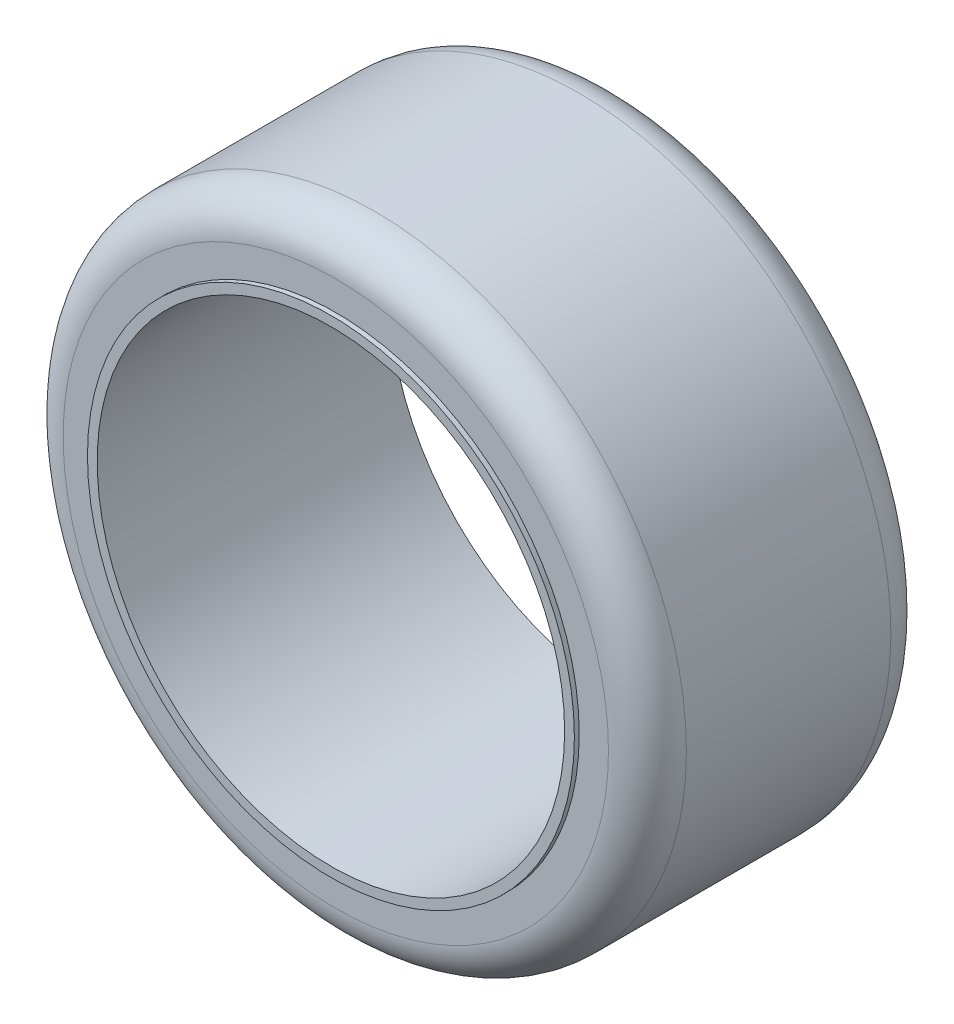
ISO-10303-21;
HEADER;
FILE_DESCRIPTION(('STEP AP214'),'2;1');
FILE_NAME('part.step','',(''),(''),'','','');
FILE_SCHEMA(('AUTOMOTIVE_DESIGN { 1 0 10303 214 1 1 1 1 }'));
ENDSEC;
DATA;
#1=APPLICATION_CONTEXT('core data for automotive mechanical design processes');
#2=APPLICATION_PROTOCOL_DEFINITION('international standard','automotive_design',2000,#1);
#3=PRODUCT_CONTEXT('',#1,'mechanical');
#4=PRODUCT('Part','Part','',(#3));
#5=PRODUCT_RELATED_PRODUCT_CATEGORY('part','',(#4));
#6=PRODUCT_DEFINITION_FORMATION('','',#4);
#7=PRODUCT_DEFINITION_CONTEXT('part definition',#1,'design');
#8=PRODUCT_DEFINITION('design','',#6,#7);
#9=PRODUCT_DEFINITION_SHAPE('','',#8);
#10=(LENGTH_UNIT() NAMED_UNIT(*) SI_UNIT(.MILLI.,.METRE.));
#11=(NAMED_UNIT(*) PLANE_ANGLE_UNIT() SI_UNIT($,.RADIAN.));
#12=(NAMED_UNIT(*) SI_UNIT($,.STERADIAN.) SOLID_ANGLE_UNIT());
#13=UNCERTAINTY_MEASURE_WITH_UNIT(LENGTH_MEASURE(1.E-05),#10,'distance_accuracy_value','');
#14=(GEOMETRIC_REPRESENTATION_CONTEXT(3) GLOBAL_UNCERTAINTY_ASSIGNED_CONTEXT((#13)) GLOBAL_UNIT_ASSIGNED_CONTEXT((#10,
#11,#12)) REPRESENTATION_CONTEXT('',''));
#15=CARTESIAN_POINT('',(0.,0.,0.));
#16=DIRECTION('',(0.,0.,1.));
#17=DIRECTION('',(1.,0.,0.));
#18=AXIS2_PLACEMENT_3D('',#15,#16,#17);
#19=CARTESIAN_POINT('',(0.,0.,0.));
#20=DIRECTION('',(0.,0.,1.));
#21=DIRECTION('',(1.,0.,0.));
#22=AXIS2_PLACEMENT_3D('',#19,#20,#21);
#23=PLANE('',#22);
#24=CARTESIAN_POINT('',(0.,0.,0.));
#25=DIRECTION('',(0.,0.,1.));
#26=DIRECTION('',(1.,0.,0.));
#27=AXIS2_PLACEMENT_3D('',#24,#25,#26);
#28=CIRCLE('',#27,24.);
#29=CARTESIAN_POINT('',(24.,0.,0.));
#30=VERTEX_POINT('',#29);
#31=EDGE_CURVE('E68',#30,#30,#28,.T.);
#32=ORIENTED_EDGE('',*,*,#31,.T.);
#33=EDGE_LOOP('',(#32));
#34=FACE_BOUND('',#33,.T.);
#35=CARTESIAN_POINT('',(0.,0.,0.));
#36=DIRECTION('',(0.,0.,1.));
#37=DIRECTION('',(1.,0.,0.));
#38=AXIS2_PLACEMENT_3D('',#35,#36,#37);
#39=CIRCLE('',#38,25.);
#40=CARTESIAN_POINT('',(25.,0.,0.));
#41=VERTEX_POINT('',#40);
#42=EDGE_CURVE('E80',#41,#41,#39,.T.);
#43=ORIENTED_EDGE('',*,*,#42,.F.);
#44=EDGE_LOOP('',(#43));
#45=FACE_BOUND('',#44,.T.);
#46=ADVANCED_FACE('F47',(#34,#45),#23,.F.);
#47=CARTESIAN_POINT('',(0.,0.,30.));
#48=DIRECTION('',(0.,0.,1.));
#49=DIRECTION('',(1.,0.,0.));
#50=AXIS2_PLACEMENT_3D('',#47,#48,#49);
#51=PLANE('',#50);
#52=CARTESIAN_POINT('',(0.,0.,30.));
#53=DIRECTION('',(0.,0.,1.));
#54=DIRECTION('',(1.,0.,0.));
#55=AXIS2_PLACEMENT_3D('',#52,#53,#54);
#56=CIRCLE('',#55,24.);
#57=CARTESIAN_POINT('',(24.,0.,30.));
#58=VERTEX_POINT('',#57);
#59=EDGE_CURVE('E67',#58,#58,#56,.T.);
#60=ORIENTED_EDGE('',*,*,#59,.F.);
#61=EDGE_LOOP('',(#60));
#62=FACE_BOUND('',#61,.T.);
#63=CARTESIAN_POINT('',(0.,0.,30.));
#64=DIRECTION('',(0.,0.,1.));
#65=DIRECTION('',(1.,0.,0.));
#66=AXIS2_PLACEMENT_3D('',#63,#64,#65);
#67=CIRCLE('',#66,25.);
#68=CARTESIAN_POINT('',(25.,0.,30.));
#69=VERTEX_POINT('',#68);
#70=EDGE_CURVE('E74',#69,#69,#67,.T.);
#71=ORIENTED_EDGE('',*,*,#70,.T.);
#72=EDGE_LOOP('',(#71));
#73=FACE_BOUND('',#72,.T.);
#74=ADVANCED_FACE('F96',(#62,#73),#51,.T.);
#75=CARTESIAN_POINT('',(0.,0.,0.));
#76=DIRECTION('',(0.,0.,1.));
#77=DIRECTION('',(1.,0.,0.));
#78=AXIS2_PLACEMENT_3D('',#75,#76,#77);
#79=CYLINDRICAL_SURFACE('',#78,32.);
#80=CARTESIAN_POINT('',(0.,0.,4.5));
#81=DIRECTION('',(0.,0.,1.));
#82=DIRECTION('',(1.,0.,0.));
#83=AXIS2_PLACEMENT_3D('',#80,#81,#82);
#84=CIRCLE('',#83,32.);
#85=CARTESIAN_POINT('',(32.,0.,4.5));
#86=VERTEX_POINT('',#85);
#87=EDGE_CURVE('E54',#86,#86,#84,.T.);
#88=ORIENTED_EDGE('',*,*,#87,.T.);
#89=EDGE_LOOP('',(#88));
#90=FACE_BOUND('',#89,.T.);
#91=CARTESIAN_POINT('',(0.,0.,25.5));
#92=DIRECTION('',(0.,0.,1.));
#93=DIRECTION('',(1.,0.,0.));
#94=AXIS2_PLACEMENT_3D('',#91,#92,#93);
#95=CIRCLE('',#94,32.);
#96=CARTESIAN_POINT('',(32.,0.,25.5));
#97=VERTEX_POINT('',#96);
#98=EDGE_CURVE('E58',#97,#97,#95,.F.);
#99=ORIENTED_EDGE('',*,*,#98,.T.);
#100=EDGE_LOOP('',(#99));
#101=FACE_BOUND('',#100,.T.);
#102=ADVANCED_FACE('F102',(#90,#101),#79,.T.);
#103=CARTESIAN_POINT('',(0.,0.,30.));
#104=DIRECTION('',(0.,0.,-1.));
#105=DIRECTION('',(-1.,0.,0.));
#106=AXIS2_PLACEMENT_3D('',#103,#104,#105);
#107=CYLINDRICAL_SURFACE('',#106,24.);
#108=ORIENTED_EDGE('',*,*,#59,.T.);
#109=EDGE_LOOP('',(#108));
#110=FACE_BOUND('',#109,.T.);
#111=ORIENTED_EDGE('',*,*,#31,.F.);
#112=EDGE_LOOP('',(#111));
#113=FACE_BOUND('',#112,.T.);
#114=ADVANCED_FACE('F127',(#110,#113),#107,.F.);
#115=CARTESIAN_POINT('',(0.,0.,29.5));
#116=DIRECTION('',(0.,0.,1.));
#117=DIRECTION('',(1.,0.,0.));
#118=AXIS2_PLACEMENT_3D('',#115,#116,#117);
#119=PLANE('',#118);
#120=CARTESIAN_POINT('',(0.,0.,29.5));
#121=DIRECTION('',(0.,0.,1.));
#122=DIRECTION('',(1.,0.,0.));
#123=AXIS2_PLACEMENT_3D('',#120,#121,#122);
#124=CIRCLE('',#123,28.);
#125=CARTESIAN_POINT('',(28.,0.,29.5));
#126=VERTEX_POINT('',#125);
#127=EDGE_CURVE('E11',#126,#126,#124,.T.);
#128=ORIENTED_EDGE('',*,*,#127,.T.);
#129=EDGE_LOOP('',(#128));
#130=FACE_BOUND('',#129,.T.);
#131=CARTESIAN_POINT('',(0.,0.,29.5));
#132=DIRECTION('',(0.,0.,1.));
#133=DIRECTION('',(1.,0.,0.));
#134=AXIS2_PLACEMENT_3D('',#131,#132,#133);
#135=CIRCLE('',#134,25.);
#136=CARTESIAN_POINT('',(25.,0.,29.5));
#137=VERTEX_POINT('',#136);
#138=EDGE_CURVE('E71',#137,#137,#135,.T.);
#139=ORIENTED_EDGE('',*,*,#138,.F.);
#140=EDGE_LOOP('',(#139));
#141=FACE_BOUND('',#140,.T.);
#142=ADVANCED_FACE('F121',(#130,#141),#119,.T.);
#143=CARTESIAN_POINT('',(0.,0.,29.5));
#144=DIRECTION('',(0.,0.,1.));
#145=DIRECTION('',(1.,0.,0.));
#146=AXIS2_PLACEMENT_3D('',#143,#144,#145);
#147=CYLINDRICAL_SURFACE('',#146,25.);
#148=ORIENTED_EDGE('',*,*,#138,.T.);
#149=EDGE_LOOP('',(#148));
#150=FACE_BOUND('',#149,.T.);
#151=ORIENTED_EDGE('',*,*,#70,.F.);
#152=EDGE_LOOP('',(#151));
#153=FACE_BOUND('',#152,.T.);
#154=ADVANCED_FACE('F116',(#150,#153),#147,.T.);
#155=CARTESIAN_POINT('',(0.,0.,0.5));
#156=DIRECTION('',(0.,0.,1.));
#157=DIRECTION('',(1.,0.,0.));
#158=AXIS2_PLACEMENT_3D('',#155,#156,#157);
#159=PLANE('',#158);
#160=CARTESIAN_POINT('',(0.,0.,0.5));
#161=DIRECTION('',(0.,0.,1.));
#162=DIRECTION('',(1.,0.,0.));
#163=AXIS2_PLACEMENT_3D('',#160,#161,#162);
#164=CIRCLE('',#163,28.);
#165=CARTESIAN_POINT('',(28.,0.,0.5));
#166=VERTEX_POINT('',#165);
#167=EDGE_CURVE('E62',#166,#166,#164,.F.);
#168=ORIENTED_EDGE('',*,*,#167,.T.);
#169=EDGE_LOOP('',(#168));
#170=FACE_BOUND('',#169,.T.);
#171=CARTESIAN_POINT('',(0.,0.,0.5));
#172=DIRECTION('',(0.,0.,1.));
#173=DIRECTION('',(1.,0.,0.));
#174=AXIS2_PLACEMENT_3D('',#171,#172,#173);
#175=CIRCLE('',#174,25.);
#176=CARTESIAN_POINT('',(25.,0.,0.5));
#177=VERTEX_POINT('',#176);
#178=EDGE_CURVE('E77',#177,#177,#175,.T.);
#179=ORIENTED_EDGE('',*,*,#178,.T.);
#180=EDGE_LOOP('',(#179));
#181=FACE_BOUND('',#180,.T.);
#182=ADVANCED_FACE('F86',(#170,#181),#159,.F.);
#183=CARTESIAN_POINT('',(0.,0.,0.5));
#184=DIRECTION('',(0.,0.,-1.));
#185=DIRECTION('',(-1.,0.,0.));
#186=AXIS2_PLACEMENT_3D('',#183,#184,#185);
#187=CYLINDRICAL_SURFACE('',#186,25.);
#188=ORIENTED_EDGE('',*,*,#178,.F.);
#189=EDGE_LOOP('',(#188));
#190=FACE_BOUND('',#189,.T.);
#191=ORIENTED_EDGE('',*,*,#42,.T.);
#192=EDGE_LOOP('',(#191));
#193=FACE_BOUND('',#192,.T.);
#194=ADVANCED_FACE('F88',(#190,#193),#187,.T.);
#195=CARTESIAN_POINT('',(0.,0.,4.5));
#196=DIRECTION('',(0.,0.,1.));
#197=DIRECTION('',(1.,0.,0.));
#198=AXIS2_PLACEMENT_3D('',#195,#196,#197);
#199=TOROIDAL_SURFACE('',#198,28.,4.);
#200=ORIENTED_EDGE('',*,*,#87,.F.);
#201=EDGE_LOOP('',(#200));
#202=FACE_BOUND('',#201,.T.);
#203=ORIENTED_EDGE('',*,*,#167,.F.);
#204=EDGE_LOOP('',(#203));
#205=FACE_BOUND('',#204,.T.);
#206=ADVANCED_FACE('F91',(#202,#205),#199,.T.);
#207=CARTESIAN_POINT('',(0.,0.,25.5));
#208=DIRECTION('',(0.,0.,1.));
#209=DIRECTION('',(1.,0.,0.));
#210=AXIS2_PLACEMENT_3D('',#207,#208,#209);
#211=TOROIDAL_SURFACE('',#210,28.,4.);
#212=ORIENTED_EDGE('',*,*,#127,.F.);
#213=EDGE_LOOP('',(#212));
#214=FACE_BOUND('',#213,.T.);
#215=ORIENTED_EDGE('',*,*,#98,.F.);
#216=EDGE_LOOP('',(#215));
#217=FACE_BOUND('',#216,.T.);
#218=ADVANCED_FACE('F49',(#214,#217),#211,.T.);
#219=CLOSED_SHELL('',(#46,#74,#102,#114,#142,#154,#182,#194,#206,#218));
#220=MANIFOLD_SOLID_BREP('B2',#219);
#221=ADVANCED_BREP_SHAPE_REPRESENTATION('',(#18,#220),#14);
#222=SHAPE_DEFINITION_REPRESENTATION(#9,#221);
ENDSEC;
END-ISO-10303-21;
